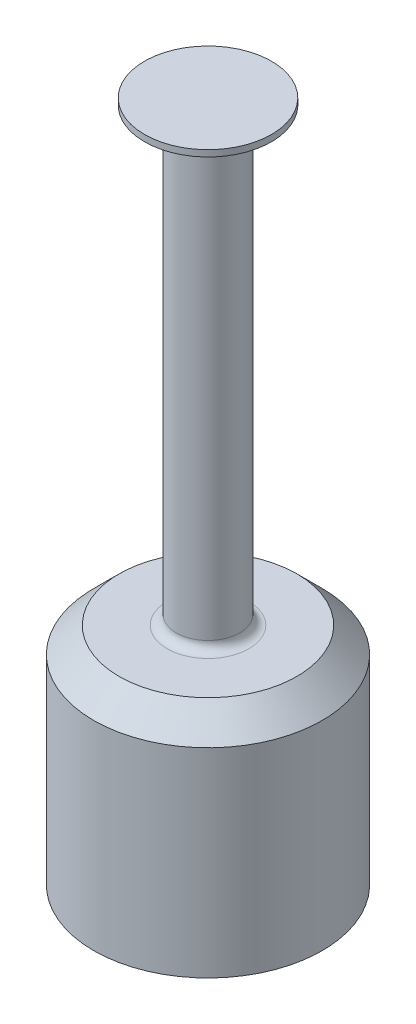
ISO-10303-21;
HEADER;
FILE_DESCRIPTION(('STEP AP214'),'2;1');
FILE_NAME('part.step','',(''),(''),'','','');
FILE_SCHEMA(('AUTOMOTIVE_DESIGN { 1 0 10303 214 1 1 1 1 }'));
ENDSEC;
DATA;
#1=APPLICATION_CONTEXT('core data for automotive mechanical design processes');
#2=APPLICATION_PROTOCOL_DEFINITION('international standard','automotive_design',2000,#1);
#3=PRODUCT_CONTEXT('',#1,'mechanical');
#4=PRODUCT('Part','Part','',(#3));
#5=PRODUCT_RELATED_PRODUCT_CATEGORY('part','',(#4));
#6=PRODUCT_DEFINITION_FORMATION('','',#4);
#7=PRODUCT_DEFINITION_CONTEXT('part definition',#1,'design');
#8=PRODUCT_DEFINITION('design','',#6,#7);
#9=PRODUCT_DEFINITION_SHAPE('','',#8);
#10=(LENGTH_UNIT() NAMED_UNIT(*) SI_UNIT(.MILLI.,.METRE.));
#11=(NAMED_UNIT(*) PLANE_ANGLE_UNIT() SI_UNIT($,.RADIAN.));
#12=(NAMED_UNIT(*) SI_UNIT($,.STERADIAN.) SOLID_ANGLE_UNIT());
#13=UNCERTAINTY_MEASURE_WITH_UNIT(LENGTH_MEASURE(1.E-05),#10,'distance_accuracy_value','');
#14=(GEOMETRIC_REPRESENTATION_CONTEXT(3) GLOBAL_UNCERTAINTY_ASSIGNED_CONTEXT((#13)) GLOBAL_UNIT_ASSIGNED_CONTEXT((#10,
#11,#12)) REPRESENTATION_CONTEXT('',''));
#15=CARTESIAN_POINT('',(0.,0.,0.));
#16=DIRECTION('',(0.,0.,1.));
#17=DIRECTION('',(1.,0.,0.));
#18=AXIS2_PLACEMENT_3D('',#15,#16,#17);
#19=CARTESIAN_POINT('',(0.,8.49999999999999,0.));
#20=DIRECTION('',(0.,1.,0.));
#21=DIRECTION('',(0.,0.,1.));
#22=AXIS2_PLACEMENT_3D('',#19,#20,#21);
#23=PLANE('',#22);
#24=DIRECTION('',(1.,0.,0.));
#25=VECTOR('',#24,1.);
#26=CARTESIAN_POINT('',(2.,8.49999999999999,1.66132477258361));
#27=LINE('',#26,#25);
#28=CARTESIAN_POINT('',(-1.99999999999999,8.5,1.66132477258361));
#29=VERTEX_POINT('',#28);
#30=CARTESIAN_POINT('',(1.99999999999999,8.5,1.6613247725836));
#31=VERTEX_POINT('',#30);
#32=EDGE_CURVE('E60',#29,#31,#27,.T.);
#33=ORIENTED_EDGE('',*,*,#32,.F.);
#34=CARTESIAN_POINT('',(0.,8.5,0.));
#35=DIRECTION('',(0.,-1.,0.));
#36=DIRECTION('',(0.,0.,-1.));
#37=AXIS2_PLACEMENT_3D('',#34,#35,#36);
#38=CIRCLE('',#37,2.59999999999999);
#39=CARTESIAN_POINT('',(-1.99999999999999,8.5,-1.6613247725836));
#40=VERTEX_POINT('',#39);
#41=EDGE_CURVE('E81',#29,#40,#38,.T.);
#42=ORIENTED_EDGE('',*,*,#41,.T.);
#43=DIRECTION('',(-1.,0.,0.));
#44=VECTOR('',#43,1.);
#45=CARTESIAN_POINT('',(-2.,8.49999999999999,-1.66132477258361));
#46=LINE('',#45,#44);
#47=CARTESIAN_POINT('',(1.99999999999999,8.5,-1.66132477258361));
#48=VERTEX_POINT('',#47);
#49=EDGE_CURVE('E83',#48,#40,#46,.T.);
#50=ORIENTED_EDGE('',*,*,#49,.F.);
#51=EDGE_CURVE('E115',#48,#31,#38,.T.);
#52=ORIENTED_EDGE('',*,*,#51,.T.);
#53=EDGE_LOOP('',(#33,#42,#50,#52));
#54=FACE_BOUND('',#53,.T.);
#55=ADVANCED_FACE('F37',(#54),#23,.F.);
#56=CARTESIAN_POINT('',(0.,0.15,0.));
#57=DIRECTION('',(0.,-1.,0.));
#58=DIRECTION('',(0.,0.,-1.));
#59=AXIS2_PLACEMENT_3D('',#56,#57,#58);
#60=CYLINDRICAL_SURFACE('',#59,2.59999999999999);
#61=CARTESIAN_POINT('',(0.,0.149999999999999,0.));
#62=DIRECTION('',(0.,-1.,0.));
#63=DIRECTION('',(0.,0.,-1.));
#64=AXIS2_PLACEMENT_3D('',#61,#62,#63);
#65=CIRCLE('',#64,2.59999999999999);
#66=CARTESIAN_POINT('',(0.,0.149999999999999,-2.59999999999999));
#67=VERTEX_POINT('',#66);
#68=EDGE_CURVE('E112',#67,#67,#65,.T.);
#69=ORIENTED_EDGE('',*,*,#68,.T.);
#70=EDGE_LOOP('',(#69));
#71=FACE_BOUND('',#70,.T.);
#72=DIRECTION('',(0.,1.,0.));
#73=VECTOR('',#72,1.);
#74=CARTESIAN_POINT('',(-2.,2.51999999999999,1.66132477258362));
#75=LINE('',#74,#73);
#76=CARTESIAN_POINT('',(-2.,2.51999999999999,1.66132477258362));
#77=VERTEX_POINT('',#76);
#78=EDGE_CURVE('E77',#77,#29,#75,.T.);
#79=ORIENTED_EDGE('',*,*,#78,.F.);
#80=CARTESIAN_POINT('',(0.,2.51999999999999,0.));
#81=DIRECTION('',(0.,-1.,0.));
#82=DIRECTION('',(0.,0.,1.));
#83=AXIS2_PLACEMENT_3D('',#80,#81,#82);
#84=CIRCLE('',#83,2.6);
#85=CARTESIAN_POINT('',(1.99999999999999,2.51999999999999,1.6613247725836));
#86=VERTEX_POINT('',#85);
#87=EDGE_CURVE('E52',#86,#77,#84,.T.);
#88=ORIENTED_EDGE('',*,*,#87,.F.);
#89=DIRECTION('',(0.,1.,0.));
#90=VECTOR('',#89,1.);
#91=CARTESIAN_POINT('',(2.,2.51999999999999,1.66132477258361));
#92=LINE('',#91,#90);
#93=EDGE_CURVE('E84',#86,#31,#92,.T.);
#94=ORIENTED_EDGE('',*,*,#93,.T.);
#95=ORIENTED_EDGE('',*,*,#51,.F.);
#96=DIRECTION('',(0.,1.,0.));
#97=VECTOR('',#96,1.);
#98=CARTESIAN_POINT('',(2.,2.51999999999999,-1.66132477258362));
#99=LINE('',#98,#97);
#100=CARTESIAN_POINT('',(2.,2.51999999999999,-1.66132477258362));
#101=VERTEX_POINT('',#100);
#102=EDGE_CURVE('E109',#101,#48,#99,.T.);
#103=ORIENTED_EDGE('',*,*,#102,.F.);
#104=CARTESIAN_POINT('',(0.,2.51999999999999,0.));
#105=DIRECTION('',(0.,-1.,0.));
#106=DIRECTION('',(0.,0.,1.));
#107=AXIS2_PLACEMENT_3D('',#104,#105,#106);
#108=CIRCLE('',#107,2.6);
#109=CARTESIAN_POINT('',(-1.99999999999999,2.51999999999999,-1.6613247725836));
#110=VERTEX_POINT('',#109);
#111=EDGE_CURVE('E99',#110,#101,#108,.T.);
#112=ORIENTED_EDGE('',*,*,#111,.F.);
#113=DIRECTION('',(0.,1.,0.));
#114=VECTOR('',#113,1.);
#115=CARTESIAN_POINT('',(-2.,2.51999999999999,-1.66132477258361));
#116=LINE('',#115,#114);
#117=EDGE_CURVE('E105',#110,#40,#116,.T.);
#118=ORIENTED_EDGE('',*,*,#117,.T.);
#119=ORIENTED_EDGE('',*,*,#41,.F.);
#120=EDGE_LOOP('',(#79,#88,#94,#95,#103,#112,#118,#119));
#121=FACE_BOUND('',#120,.T.);
#122=ADVANCED_FACE('F79',(#71,#121),#60,.F.);
#123=CARTESIAN_POINT('',(0.,9.,0.));
#124=DIRECTION('',(0.,-1.,0.));
#125=DIRECTION('',(0.,0.,-1.));
#126=AXIS2_PLACEMENT_3D('',#123,#124,#125);
#127=CYLINDRICAL_SURFACE('',#126,4.5);
#128=CARTESIAN_POINT('',(0.,8.00000000000001,0.));
#129=DIRECTION('',(0.,1.,0.));
#130=DIRECTION('',(0.,0.,1.));
#131=AXIS2_PLACEMENT_3D('',#128,#129,#130);
#132=CIRCLE('',#131,4.5);
#133=CARTESIAN_POINT('',(0.,8.00000000000001,4.5));
#134=VERTEX_POINT('',#133);
#135=EDGE_CURVE('E120',#134,#134,#132,.F.);
#136=ORIENTED_EDGE('',*,*,#135,.T.);
#137=EDGE_LOOP('',(#136));
#138=FACE_BOUND('',#137,.T.);
#139=CARTESIAN_POINT('',(0.,0.150000000000001,0.));
#140=DIRECTION('',(0.,-1.,0.));
#141=DIRECTION('',(0.,0.,-1.));
#142=AXIS2_PLACEMENT_3D('',#139,#140,#141);
#143=CIRCLE('',#142,4.5);
#144=CARTESIAN_POINT('',(0.,0.150000000000001,-4.5));
#145=VERTEX_POINT('',#144);
#146=EDGE_CURVE('E117',#145,#145,#143,.T.);
#147=ORIENTED_EDGE('',*,*,#146,.F.);
#148=EDGE_LOOP('',(#147));
#149=FACE_BOUND('',#148,.T.);
#150=ADVANCED_FACE('F145',(#138,#149),#127,.T.);
#151=CARTESIAN_POINT('',(4.5,9.,0.));
#152=DIRECTION('',(0.,1.,0.));
#153=DIRECTION('',(0.,0.,1.));
#154=AXIS2_PLACEMENT_3D('',#151,#152,#153);
#155=PLANE('',#154);
#156=CARTESIAN_POINT('',(0.,9.,0.));
#157=DIRECTION('',(0.,1.,0.));
#158=DIRECTION('',(0.,0.,1.));
#159=AXIS2_PLACEMENT_3D('',#156,#157,#158);
#160=CIRCLE('',#159,1.61);
#161=CARTESIAN_POINT('',(0.,9.,1.61));
#162=VERTEX_POINT('',#161);
#163=EDGE_CURVE('E11',#162,#162,#160,.F.);
#164=ORIENTED_EDGE('',*,*,#163,.T.);
#165=EDGE_LOOP('',(#164));
#166=FACE_BOUND('',#165,.T.);
#167=CARTESIAN_POINT('',(0.,9.,0.));
#168=DIRECTION('',(0.,1.,0.));
#169=DIRECTION('',(0.,0.,1.));
#170=AXIS2_PLACEMENT_3D('',#167,#168,#169);
#171=CIRCLE('',#170,3.5);
#172=CARTESIAN_POINT('',(0.,9.,3.5));
#173=VERTEX_POINT('',#172);
#174=EDGE_CURVE('E123',#173,#173,#171,.T.);
#175=ORIENTED_EDGE('',*,*,#174,.T.);
#176=EDGE_LOOP('',(#175));
#177=FACE_BOUND('',#176,.T.);
#178=ADVANCED_FACE('F154',(#166,#177),#155,.T.);
#179=CARTESIAN_POINT('',(0.,0.15,0.));
#180=DIRECTION('',(0.,-1.,0.));
#181=DIRECTION('',(0.,0.,-1.));
#182=AXIS2_PLACEMENT_3D('',#179,#180,#181);
#183=PLANE('',#182);
#184=ORIENTED_EDGE('',*,*,#68,.F.);
#185=EDGE_LOOP('',(#184));
#186=FACE_BOUND('',#185,.T.);
#187=ORIENTED_EDGE('',*,*,#146,.T.);
#188=EDGE_LOOP('',(#187));
#189=FACE_BOUND('',#188,.T.);
#190=ADVANCED_FACE('F150',(#186,#189),#183,.T.);
#191=CARTESIAN_POINT('',(-2.,2.51999999999999,-1.66132477258361));
#192=DIRECTION('',(0.,0.,-1.));
#193=DIRECTION('',(-1.,0.,0.));
#194=AXIS2_PLACEMENT_3D('',#191,#192,#193);
#195=PLANE('',#194);
#196=ORIENTED_EDGE('',*,*,#49,.T.);
#197=ORIENTED_EDGE('',*,*,#117,.F.);
#198=DIRECTION('',(-1.,0.,0.));
#199=VECTOR('',#198,1.);
#200=CARTESIAN_POINT('',(-2.,2.51999999999999,-1.66132477258361));
#201=LINE('',#200,#199);
#202=EDGE_CURVE('E102',#101,#110,#201,.T.);
#203=ORIENTED_EDGE('',*,*,#202,.F.);
#204=ORIENTED_EDGE('',*,*,#102,.T.);
#205=EDGE_LOOP('',(#196,#197,#203,#204));
#206=FACE_BOUND('',#205,.T.);
#207=ADVANCED_FACE('F153',(#206),#195,.F.);
#208=CARTESIAN_POINT('',(0.,2.51999999999999,0.));
#209=DIRECTION('',(0.,1.,0.));
#210=DIRECTION('',(0.,0.,1.));
#211=AXIS2_PLACEMENT_3D('',#208,#209,#210);
#212=PLANE('',#211);
#213=ORIENTED_EDGE('',*,*,#111,.T.);
#214=ORIENTED_EDGE('',*,*,#202,.T.);
#215=EDGE_LOOP('',(#213,#214));
#216=FACE_BOUND('',#215,.T.);
#217=ADVANCED_FACE('F190',(#216),#212,.F.);
#218=CARTESIAN_POINT('',(2.,2.51999999999999,1.66132477258361));
#219=DIRECTION('',(0.,0.,1.));
#220=DIRECTION('',(1.,0.,0.));
#221=AXIS2_PLACEMENT_3D('',#218,#219,#220);
#222=PLANE('',#221);
#223=ORIENTED_EDGE('',*,*,#32,.T.);
#224=ORIENTED_EDGE('',*,*,#93,.F.);
#225=DIRECTION('',(1.,0.,0.));
#226=VECTOR('',#225,1.);
#227=CARTESIAN_POINT('',(2.,2.51999999999999,1.66132477258361));
#228=LINE('',#227,#226);
#229=EDGE_CURVE('E87',#77,#86,#228,.T.);
#230=ORIENTED_EDGE('',*,*,#229,.F.);
#231=ORIENTED_EDGE('',*,*,#78,.T.);
#232=EDGE_LOOP('',(#223,#224,#230,#231));
#233=FACE_BOUND('',#232,.T.);
#234=ADVANCED_FACE('F88',(#233),#222,.F.);
#235=CARTESIAN_POINT('',(0.,2.51999999999999,0.));
#236=DIRECTION('',(0.,1.,0.));
#237=DIRECTION('',(0.,0.,1.));
#238=AXIS2_PLACEMENT_3D('',#235,#236,#237);
#239=PLANE('',#238);
#240=ORIENTED_EDGE('',*,*,#87,.T.);
#241=ORIENTED_EDGE('',*,*,#229,.T.);
#242=EDGE_LOOP('',(#240,#241));
#243=FACE_BOUND('',#242,.T.);
#244=ADVANCED_FACE('F91',(#243),#239,.F.);
#245=CARTESIAN_POINT('',(0.,25.8520028549595,0.));
#246=DIRECTION('',(0.,-1.,0.));
#247=DIRECTION('',(0.,0.,-1.));
#248=AXIS2_PLACEMENT_3D('',#245,#246,#247);
#249=CYLINDRICAL_SURFACE('',#248,1.25);
#250=CARTESIAN_POINT('',(0.,9.36,0.));
#251=DIRECTION('',(0.,1.,0.));
#252=DIRECTION('',(0.,0.,1.));
#253=AXIS2_PLACEMENT_3D('',#250,#251,#252);
#254=CIRCLE('',#253,1.25);
#255=CARTESIAN_POINT('',(0.,9.36,1.25));
#256=VERTEX_POINT('',#255);
#257=EDGE_CURVE('E45',#256,#256,#254,.T.);
#258=ORIENTED_EDGE('',*,*,#257,.T.);
#259=EDGE_LOOP('',(#258));
#260=FACE_BOUND('',#259,.T.);
#261=CARTESIAN_POINT('',(0.,25.8520028549595,0.));
#262=DIRECTION('',(0.,1.,0.));
#263=DIRECTION('',(0.,0.,1.));
#264=AXIS2_PLACEMENT_3D('',#261,#262,#263);
#265=CIRCLE('',#264,1.25);
#266=CARTESIAN_POINT('',(0.,25.8520028549595,1.25));
#267=VERTEX_POINT('',#266);
#268=EDGE_CURVE('E93',#267,#267,#265,.T.);
#269=ORIENTED_EDGE('',*,*,#268,.F.);
#270=EDGE_LOOP('',(#269));
#271=FACE_BOUND('',#270,.T.);
#272=ADVANCED_FACE('F128',(#260,#271),#249,.T.);
#273=CARTESIAN_POINT('',(0.,25.8520028549595,0.));
#274=DIRECTION('',(0.,1.,0.));
#275=DIRECTION('',(0.,0.,1.));
#276=AXIS2_PLACEMENT_3D('',#273,#274,#275);
#277=CONICAL_SURFACE('',#276,1.24999999999999,0.958945304064456);
#278=CARTESIAN_POINT('',(0.,26.7290999285359,0.));
#279=DIRECTION('',(0.,1.,0.));
#280=DIRECTION('',(0.,0.,1.));
#281=AXIS2_PLACEMENT_3D('',#278,#279,#280);
#282=CIRCLE('',#281,2.49999999999996);
#283=CARTESIAN_POINT('',(0.,26.7290999285359,2.49999999999996));
#284=VERTEX_POINT('',#283);
#285=EDGE_CURVE('E281',#284,#284,#282,.T.);
#286=ORIENTED_EDGE('',*,*,#285,.F.);
#287=EDGE_LOOP('',(#286));
#288=FACE_BOUND('',#287,.T.);
#289=ORIENTED_EDGE('',*,*,#268,.T.);
#290=EDGE_LOOP('',(#289));
#291=FACE_BOUND('',#290,.T.);
#292=ADVANCED_FACE('F216',(#288,#291),#277,.T.);
#293=CARTESIAN_POINT('',(0.,26.9790999285359,0.));
#294=DIRECTION('',(0.,-1.,0.));
#295=DIRECTION('',(0.,0.,-1.));
#296=AXIS2_PLACEMENT_3D('',#293,#294,#295);
#297=CYLINDRICAL_SURFACE('',#296,2.5);
#298=CARTESIAN_POINT('',(0.,26.9790999285359,0.));
#299=DIRECTION('',(0.,1.,0.));
#300=DIRECTION('',(0.,0.,1.));
#301=AXIS2_PLACEMENT_3D('',#298,#299,#300);
#302=CIRCLE('',#301,2.5);
#303=CARTESIAN_POINT('',(0.,26.9790999285359,2.5));
#304=VERTEX_POINT('',#303);
#305=EDGE_CURVE('E280',#304,#304,#302,.T.);
#306=ORIENTED_EDGE('',*,*,#305,.F.);
#307=EDGE_LOOP('',(#306));
#308=FACE_BOUND('',#307,.T.);
#309=ORIENTED_EDGE('',*,*,#285,.T.);
#310=EDGE_LOOP('',(#309));
#311=FACE_BOUND('',#310,.T.);
#312=ADVANCED_FACE('F222',(#308,#311),#297,.T.);
#313=CARTESIAN_POINT('',(0.,26.9790999285359,0.));
#314=DIRECTION('',(0.,1.,0.));
#315=DIRECTION('',(0.,0.,1.));
#316=AXIS2_PLACEMENT_3D('',#313,#314,#315);
#317=PLANE('',#316);
#318=ORIENTED_EDGE('',*,*,#305,.T.);
#319=EDGE_LOOP('',(#318));
#320=FACE_BOUND('',#319,.T.);
#321=ADVANCED_FACE('F137',(#320),#317,.T.);
#322=CARTESIAN_POINT('',(0.,8.00000000000001,0.));
#323=DIRECTION('',(0.,-1.,0.));
#324=DIRECTION('',(0.,0.,-1.));
#325=AXIS2_PLACEMENT_3D('',#322,#323,#324);
#326=CONICAL_SURFACE('',#325,4.5,0.785398163397451);
#327=ORIENTED_EDGE('',*,*,#174,.F.);
#328=EDGE_LOOP('',(#327));
#329=FACE_BOUND('',#328,.T.);
#330=ORIENTED_EDGE('',*,*,#135,.F.);
#331=EDGE_LOOP('',(#330));
#332=FACE_BOUND('',#331,.T.);
#333=ADVANCED_FACE('F132',(#329,#332),#326,.T.);
#334=CARTESIAN_POINT('',(0.,9.36,0.));
#335=DIRECTION('',(0.,1.,0.));
#336=DIRECTION('',(0.,0.,1.));
#337=AXIS2_PLACEMENT_3D('',#334,#335,#336);
#338=TOROIDAL_SURFACE('',#337,1.61,0.36);
#339=ORIENTED_EDGE('',*,*,#163,.F.);
#340=EDGE_LOOP('',(#339));
#341=FACE_BOUND('',#340,.T.);
#342=ORIENTED_EDGE('',*,*,#257,.F.);
#343=EDGE_LOOP('',(#342));
#344=FACE_BOUND('',#343,.T.);
#345=ADVANCED_FACE('F39',(#341,#344),#338,.F.);
#346=CLOSED_SHELL('',(#55,#122,#150,#178,#190,#207,#217,#234,#244,#272,#292,#312,#321,#333,#345));
#347=MANIFOLD_SOLID_BREP('B2',#346);
#348=ADVANCED_BREP_SHAPE_REPRESENTATION('',(#18,#347),#14);
#349=SHAPE_DEFINITION_REPRESENTATION(#9,#348);
ENDSEC;
END-ISO-10303-21;
